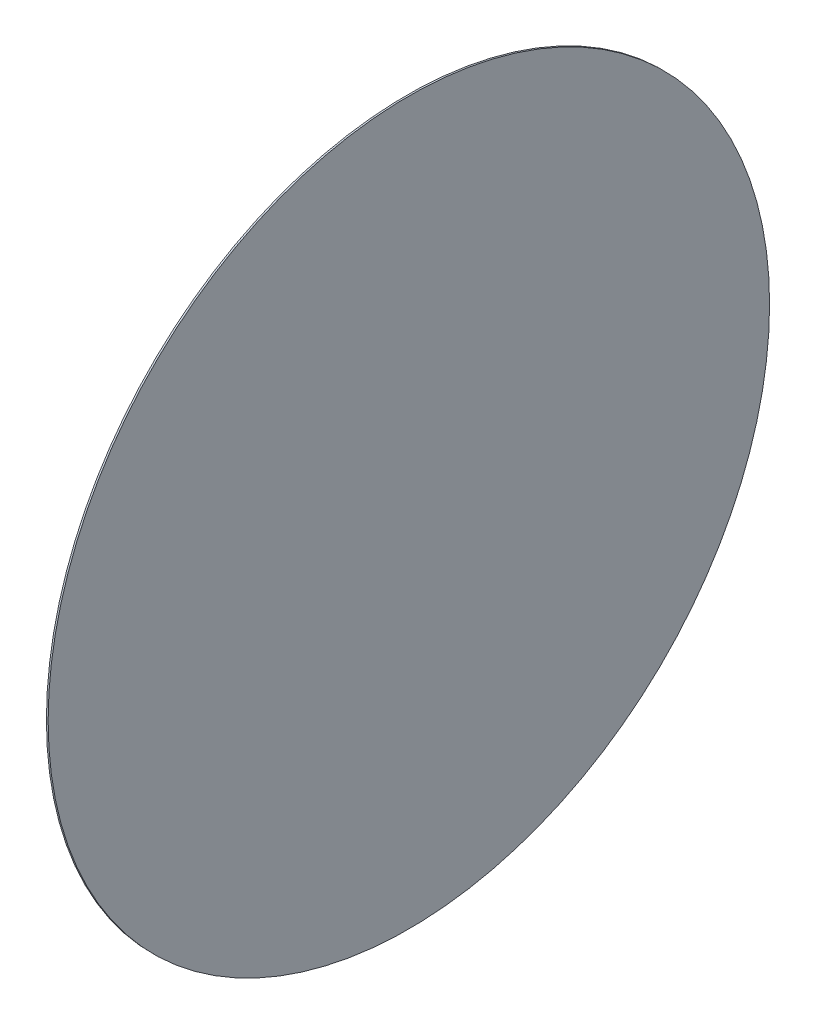
ISO-10303-21;
HEADER;
FILE_DESCRIPTION(('STEP AP214'),'2;1');
FILE_NAME('part.step','',(''),(''),'','','');
FILE_SCHEMA(('AUTOMOTIVE_DESIGN { 1 0 10303 214 1 1 1 1 }'));
ENDSEC;
DATA;
#1=APPLICATION_CONTEXT('core data for automotive mechanical design processes');
#2=APPLICATION_PROTOCOL_DEFINITION('international standard','automotive_design',2000,#1);
#3=PRODUCT_CONTEXT('',#1,'mechanical');
#4=PRODUCT('Part','Part','',(#3));
#5=PRODUCT_RELATED_PRODUCT_CATEGORY('part','',(#4));
#6=PRODUCT_DEFINITION_FORMATION('','',#4);
#7=PRODUCT_DEFINITION_CONTEXT('part definition',#1,'design');
#8=PRODUCT_DEFINITION('design','',#6,#7);
#9=PRODUCT_DEFINITION_SHAPE('','',#8);
#10=(LENGTH_UNIT() NAMED_UNIT(*) SI_UNIT(.MILLI.,.METRE.));
#11=(NAMED_UNIT(*) PLANE_ANGLE_UNIT() SI_UNIT($,.RADIAN.));
#12=(NAMED_UNIT(*) SI_UNIT($,.STERADIAN.) SOLID_ANGLE_UNIT());
#13=UNCERTAINTY_MEASURE_WITH_UNIT(LENGTH_MEASURE(1.E-05),#10,'distance_accuracy_value','');
#14=(GEOMETRIC_REPRESENTATION_CONTEXT(3) GLOBAL_UNCERTAINTY_ASSIGNED_CONTEXT((#13)) GLOBAL_UNIT_ASSIGNED_CONTEXT((#10,
#11,#12)) REPRESENTATION_CONTEXT('',''));
#15=CARTESIAN_POINT('',(0.,0.,0.));
#16=DIRECTION('',(0.,0.,1.));
#17=DIRECTION('',(1.,0.,0.));
#18=AXIS2_PLACEMENT_3D('',#15,#16,#17);
#19=CARTESIAN_POINT('',(0.,0.,0.));
#20=DIRECTION('',(-1.,0.,0.));
#21=DIRECTION('',(0.,0.,1.));
#22=AXIS2_PLACEMENT_3D('',#19,#20,#21);
#23=CYLINDRICAL_SURFACE('',#22,9.);
#24=CARTESIAN_POINT('',(0.,0.,0.));
#25=DIRECTION('',(-1.,0.,0.));
#26=DIRECTION('',(0.,0.,1.));
#27=AXIS2_PLACEMENT_3D('',#24,#25,#26);
#28=CIRCLE('',#27,9.);
#29=CARTESIAN_POINT('',(0.,0.,9.));
#30=VERTEX_POINT('',#29);
#31=EDGE_CURVE('E44',#30,#30,#28,.T.);
#32=ORIENTED_EDGE('',*,*,#31,.F.);
#33=EDGE_LOOP('',(#32));
#34=FACE_BOUND('',#33,.T.);
#35=CARTESIAN_POINT('',(0.0429999999999988,0.,0.));
#36=DIRECTION('',(-1.,0.,0.));
#37=DIRECTION('',(0.,0.,1.));
#38=AXIS2_PLACEMENT_3D('',#35,#36,#37);
#39=CIRCLE('',#38,9.);
#40=CARTESIAN_POINT('',(0.0429999999999988,0.,9.));
#41=VERTEX_POINT('',#40);
#42=EDGE_CURVE('E10',#41,#41,#39,.T.);
#43=ORIENTED_EDGE('',*,*,#42,.T.);
#44=EDGE_LOOP('',(#43));
#45=FACE_BOUND('',#44,.T.);
#46=ADVANCED_FACE('F37',(#34,#45),#23,.T.);
#47=CARTESIAN_POINT('',(0.0429999999999994,9.,0.));
#48=DIRECTION('',(-1.,0.,0.));
#49=DIRECTION('',(0.,0.,1.));
#50=AXIS2_PLACEMENT_3D('',#47,#48,#49);
#51=PLANE('',#50);
#52=ORIENTED_EDGE('',*,*,#42,.F.);
#53=EDGE_LOOP('',(#52));
#54=FACE_BOUND('',#53,.T.);
#55=ADVANCED_FACE('F54',(#54),#51,.F.);
#56=CARTESIAN_POINT('',(0.,9.,0.));
#57=DIRECTION('',(1.,0.,0.));
#58=DIRECTION('',(0.,0.,-1.));
#59=AXIS2_PLACEMENT_3D('',#56,#57,#58);
#60=PLANE('',#59);
#61=ORIENTED_EDGE('',*,*,#31,.T.);
#62=EDGE_LOOP('',(#61));
#63=FACE_BOUND('',#62,.T.);
#64=ADVANCED_FACE('F51',(#63),#60,.F.);
#65=CLOSED_SHELL('',(#46,#55,#64));
#66=MANIFOLD_SOLID_BREP('B2',#65);
#67=ADVANCED_BREP_SHAPE_REPRESENTATION('',(#18,#66),#14);
#68=SHAPE_DEFINITION_REPRESENTATION(#9,#67);
ENDSEC;
END-ISO-10303-21;
